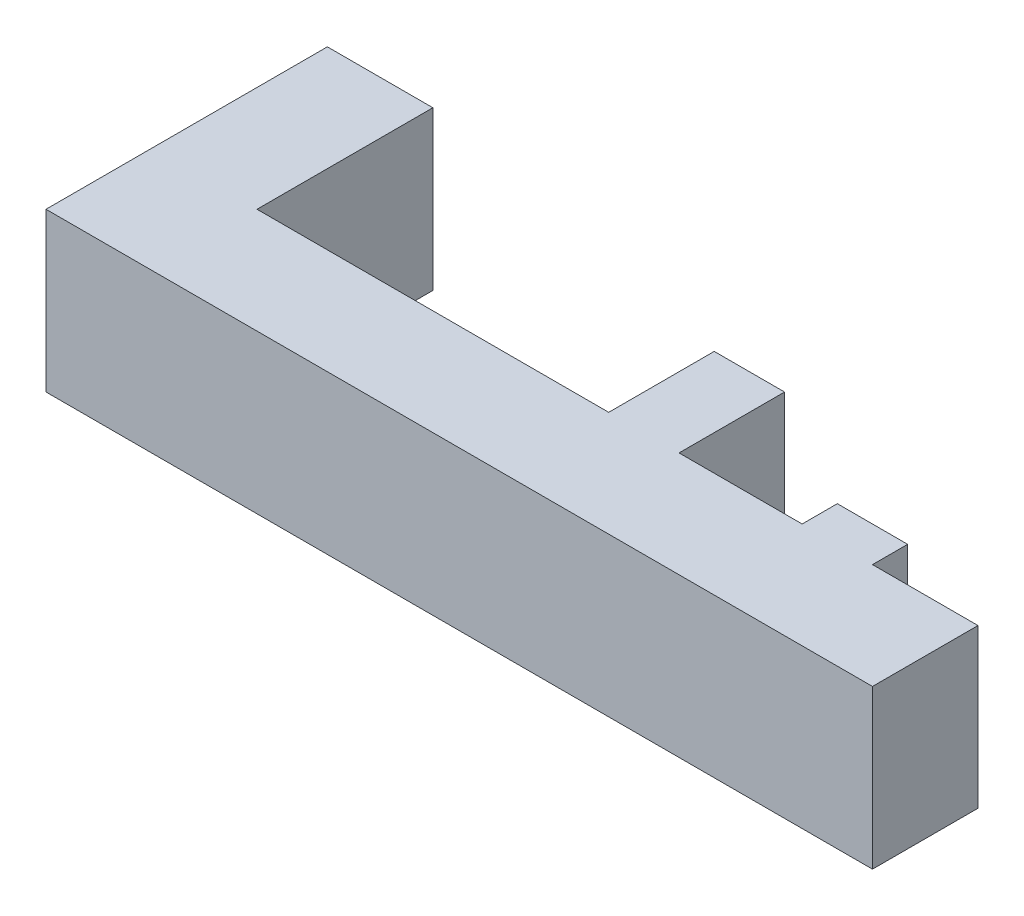
ISO-10303-21;
HEADER;
FILE_DESCRIPTION(('STEP AP214'),'2;1');
FILE_NAME('part.step','',(''),(''),'','','');
FILE_SCHEMA(('AUTOMOTIVE_DESIGN { 1 0 10303 214 1 1 1 1 }'));
ENDSEC;
DATA;
#1=APPLICATION_CONTEXT('core data for automotive mechanical design processes');
#2=APPLICATION_PROTOCOL_DEFINITION('international standard','automotive_design',2000,#1);
#3=PRODUCT_CONTEXT('',#1,'mechanical');
#4=PRODUCT('Part','Part','',(#3));
#5=PRODUCT_RELATED_PRODUCT_CATEGORY('part','',(#4));
#6=PRODUCT_DEFINITION_FORMATION('','',#4);
#7=PRODUCT_DEFINITION_CONTEXT('part definition',#1,'design');
#8=PRODUCT_DEFINITION('design','',#6,#7);
#9=PRODUCT_DEFINITION_SHAPE('','',#8);
#10=(LENGTH_UNIT() NAMED_UNIT(*) SI_UNIT(.MILLI.,.METRE.));
#11=(NAMED_UNIT(*) PLANE_ANGLE_UNIT() SI_UNIT($,.RADIAN.));
#12=(NAMED_UNIT(*) SI_UNIT($,.STERADIAN.) SOLID_ANGLE_UNIT());
#13=UNCERTAINTY_MEASURE_WITH_UNIT(LENGTH_MEASURE(1.E-05),#10,'distance_accuracy_value','');
#14=(GEOMETRIC_REPRESENTATION_CONTEXT(3) GLOBAL_UNCERTAINTY_ASSIGNED_CONTEXT((#13)) GLOBAL_UNIT_ASSIGNED_CONTEXT((#10,
#11,#12)) REPRESENTATION_CONTEXT('',''));
#15=CARTESIAN_POINT('',(0.,0.,0.));
#16=DIRECTION('',(0.,0.,1.));
#17=DIRECTION('',(1.,0.,0.));
#18=AXIS2_PLACEMENT_3D('',#15,#16,#17);
#19=CARTESIAN_POINT('',(13.,4.5,-6.));
#20=DIRECTION('',(0.,0.,1.));
#21=DIRECTION('',(1.,0.,0.));
#22=AXIS2_PLACEMENT_3D('',#19,#20,#21);
#23=PLANE('',#22);
#24=DIRECTION('',(-1.,0.,0.));
#25=VECTOR('',#24,1.);
#26=CARTESIAN_POINT('',(13.,0.,-6.));
#27=LINE('',#26,#25);
#28=CARTESIAN_POINT('',(15.,0.,-6.));
#29=VERTEX_POINT('',#28);
#30=CARTESIAN_POINT('',(13.,0.,-6.));
#31=VERTEX_POINT('',#30);
#32=EDGE_CURVE('E164',#29,#31,#27,.T.);
#33=ORIENTED_EDGE('',*,*,#32,.T.);
#34=DIRECTION('',(0.,-1.,0.));
#35=VECTOR('',#34,1.);
#36=CARTESIAN_POINT('',(13.,4.5,-6.));
#37=LINE('',#36,#35);
#38=CARTESIAN_POINT('',(13.,4.5,-6.));
#39=VERTEX_POINT('',#38);
#40=EDGE_CURVE('E11',#39,#31,#37,.T.);
#41=ORIENTED_EDGE('',*,*,#40,.F.);
#42=DIRECTION('',(-1.,0.,0.));
#43=VECTOR('',#42,1.);
#44=CARTESIAN_POINT('',(13.,4.5,-6.));
#45=LINE('',#44,#43);
#46=CARTESIAN_POINT('',(15.,4.5,-6.));
#47=VERTEX_POINT('',#46);
#48=EDGE_CURVE('E190',#47,#39,#45,.T.);
#49=ORIENTED_EDGE('',*,*,#48,.F.);
#50=DIRECTION('',(0.,-1.,0.));
#51=VECTOR('',#50,1.);
#52=CARTESIAN_POINT('',(15.,4.5,-6.));
#53=LINE('',#52,#51);
#54=EDGE_CURVE('E160',#47,#29,#53,.T.);
#55=ORIENTED_EDGE('',*,*,#54,.T.);
#56=EDGE_LOOP('',(#33,#41,#49,#55));
#57=FACE_BOUND('',#56,.T.);
#58=ADVANCED_FACE('F32',(#57),#23,.F.);
#59=CARTESIAN_POINT('',(13.,4.5,-6.));
#60=DIRECTION('',(1.,0.,0.));
#61=DIRECTION('',(0.,0.,-1.));
#62=AXIS2_PLACEMENT_3D('',#59,#60,#61);
#63=PLANE('',#62);
#64=DIRECTION('',(0.,0.,1.));
#65=VECTOR('',#64,1.);
#66=CARTESIAN_POINT('',(13.,0.,-6.));
#67=LINE('',#66,#65);
#68=CARTESIAN_POINT('',(13.,0.,-3.));
#69=VERTEX_POINT('',#68);
#70=EDGE_CURVE('E167',#31,#69,#67,.T.);
#71=ORIENTED_EDGE('',*,*,#70,.T.);
#72=DIRECTION('',(0.,-1.,0.));
#73=VECTOR('',#72,1.);
#74=CARTESIAN_POINT('',(13.,4.5,-3.));
#75=LINE('',#74,#73);
#76=CARTESIAN_POINT('',(13.,4.5,-3.));
#77=VERTEX_POINT('',#76);
#78=EDGE_CURVE('E40',#77,#69,#75,.T.);
#79=ORIENTED_EDGE('',*,*,#78,.F.);
#80=DIRECTION('',(0.,0.,1.));
#81=VECTOR('',#80,1.);
#82=CARTESIAN_POINT('',(13.,4.5,-6.));
#83=LINE('',#82,#81);
#84=EDGE_CURVE('E109',#39,#77,#83,.T.);
#85=ORIENTED_EDGE('',*,*,#84,.F.);
#86=ORIENTED_EDGE('',*,*,#40,.T.);
#87=EDGE_LOOP('',(#71,#79,#85,#86));
#88=FACE_BOUND('',#87,.T.);
#89=ADVANCED_FACE('F278',(#88),#63,.F.);
#90=CARTESIAN_POINT('',(13.,4.5,-3.));
#91=DIRECTION('',(0.,0.,1.));
#92=DIRECTION('',(1.,0.,0.));
#93=AXIS2_PLACEMENT_3D('',#90,#91,#92);
#94=PLANE('',#93);
#95=DIRECTION('',(-1.,0.,0.));
#96=VECTOR('',#95,1.);
#97=CARTESIAN_POINT('',(13.,0.,-3.));
#98=LINE('',#97,#96);
#99=CARTESIAN_POINT('',(3.,0.,-3.));
#100=VERTEX_POINT('',#99);
#101=EDGE_CURVE('E169',#69,#100,#98,.T.);
#102=ORIENTED_EDGE('',*,*,#101,.T.);
#103=DIRECTION('',(0.,-1.,0.));
#104=VECTOR('',#103,1.);
#105=CARTESIAN_POINT('',(3.,4.5,-3.));
#106=LINE('',#105,#104);
#107=CARTESIAN_POINT('',(3.,4.5,-3.));
#108=VERTEX_POINT('',#107);
#109=EDGE_CURVE('E215',#108,#100,#106,.T.);
#110=ORIENTED_EDGE('',*,*,#109,.F.);
#111=DIRECTION('',(-1.,0.,0.));
#112=VECTOR('',#111,1.);
#113=CARTESIAN_POINT('',(13.,4.5,-3.));
#114=LINE('',#113,#112);
#115=EDGE_CURVE('E223',#77,#108,#114,.T.);
#116=ORIENTED_EDGE('',*,*,#115,.F.);
#117=ORIENTED_EDGE('',*,*,#78,.T.);
#118=EDGE_LOOP('',(#102,#110,#116,#117));
#119=FACE_BOUND('',#118,.T.);
#120=ADVANCED_FACE('F221',(#119),#94,.F.);
#121=CARTESIAN_POINT('',(3.,4.5,-3.));
#122=DIRECTION('',(-1.,0.,0.));
#123=DIRECTION('',(0.,0.,1.));
#124=AXIS2_PLACEMENT_3D('',#121,#122,#123);
#125=PLANE('',#124);
#126=DIRECTION('',(0.,0.,-1.));
#127=VECTOR('',#126,1.);
#128=CARTESIAN_POINT('',(3.,0.,-3.));
#129=LINE('',#128,#127);
#130=CARTESIAN_POINT('',(3.,0.,-8.));
#131=VERTEX_POINT('',#130);
#132=EDGE_CURVE('E171',#100,#131,#129,.T.);
#133=ORIENTED_EDGE('',*,*,#132,.T.);
#134=DIRECTION('',(0.,-1.,0.));
#135=VECTOR('',#134,1.);
#136=CARTESIAN_POINT('',(3.,4.5,-8.));
#137=LINE('',#136,#135);
#138=CARTESIAN_POINT('',(3.,4.5,-8.));
#139=VERTEX_POINT('',#138);
#140=EDGE_CURVE('E212',#139,#131,#137,.T.);
#141=ORIENTED_EDGE('',*,*,#140,.F.);
#142=DIRECTION('',(0.,0.,-1.));
#143=VECTOR('',#142,1.);
#144=CARTESIAN_POINT('',(3.,4.5,-3.));
#145=LINE('',#144,#143);
#146=EDGE_CURVE('E241',#108,#139,#145,.T.);
#147=ORIENTED_EDGE('',*,*,#146,.F.);
#148=ORIENTED_EDGE('',*,*,#109,.T.);
#149=EDGE_LOOP('',(#133,#141,#147,#148));
#150=FACE_BOUND('',#149,.T.);
#151=ADVANCED_FACE('F232',(#150),#125,.F.);
#152=CARTESIAN_POINT('',(3.,4.5,-8.));
#153=DIRECTION('',(0.,0.,1.));
#154=DIRECTION('',(1.,0.,0.));
#155=AXIS2_PLACEMENT_3D('',#152,#153,#154);
#156=PLANE('',#155);
#157=DIRECTION('',(-1.,0.,0.));
#158=VECTOR('',#157,1.);
#159=CARTESIAN_POINT('',(3.,0.,-8.));
#160=LINE('',#159,#158);
#161=CARTESIAN_POINT('',(0.,0.,-8.));
#162=VERTEX_POINT('',#161);
#163=EDGE_CURVE('E173',#131,#162,#160,.T.);
#164=ORIENTED_EDGE('',*,*,#163,.T.);
#165=DIRECTION('',(0.,-1.,0.));
#166=VECTOR('',#165,1.);
#167=CARTESIAN_POINT('',(0.,4.5,-8.));
#168=LINE('',#167,#166);
#169=CARTESIAN_POINT('',(0.,4.5,-8.));
#170=VERTEX_POINT('',#169);
#171=EDGE_CURVE('E209',#170,#162,#168,.T.);
#172=ORIENTED_EDGE('',*,*,#171,.F.);
#173=DIRECTION('',(-1.,0.,0.));
#174=VECTOR('',#173,1.);
#175=CARTESIAN_POINT('',(3.,4.5,-8.));
#176=LINE('',#175,#174);
#177=EDGE_CURVE('E238',#139,#170,#176,.T.);
#178=ORIENTED_EDGE('',*,*,#177,.F.);
#179=ORIENTED_EDGE('',*,*,#140,.T.);
#180=EDGE_LOOP('',(#164,#172,#178,#179));
#181=FACE_BOUND('',#180,.T.);
#182=ADVANCED_FACE('F236',(#181),#156,.F.);
#183=CARTESIAN_POINT('',(0.,4.5,-8.));
#184=DIRECTION('',(1.,0.,0.));
#185=DIRECTION('',(0.,0.,-1.));
#186=AXIS2_PLACEMENT_3D('',#183,#184,#185);
#187=PLANE('',#186);
#188=DIRECTION('',(0.,0.,1.));
#189=VECTOR('',#188,1.);
#190=CARTESIAN_POINT('',(0.,0.,-8.));
#191=LINE('',#190,#189);
#192=CARTESIAN_POINT('',(0.,0.,0.));
#193=VERTEX_POINT('',#192);
#194=EDGE_CURVE('E175',#162,#193,#191,.T.);
#195=ORIENTED_EDGE('',*,*,#194,.T.);
#196=DIRECTION('',(0.,-1.,0.));
#197=VECTOR('',#196,1.);
#198=CARTESIAN_POINT('',(0.,4.5,0.));
#199=LINE('',#198,#197);
#200=CARTESIAN_POINT('',(0.,4.5,0.));
#201=VERTEX_POINT('',#200);
#202=EDGE_CURVE('E206',#201,#193,#199,.T.);
#203=ORIENTED_EDGE('',*,*,#202,.F.);
#204=DIRECTION('',(0.,0.,1.));
#205=VECTOR('',#204,1.);
#206=CARTESIAN_POINT('',(0.,4.5,-8.));
#207=LINE('',#206,#205);
#208=EDGE_CURVE('E240',#170,#201,#207,.T.);
#209=ORIENTED_EDGE('',*,*,#208,.F.);
#210=ORIENTED_EDGE('',*,*,#171,.T.);
#211=EDGE_LOOP('',(#195,#203,#209,#210));
#212=FACE_BOUND('',#211,.T.);
#213=ADVANCED_FACE('F291',(#212),#187,.F.);
#214=CARTESIAN_POINT('',(0.,4.5,0.));
#215=DIRECTION('',(0.,0.,-1.));
#216=DIRECTION('',(-1.,0.,0.));
#217=AXIS2_PLACEMENT_3D('',#214,#215,#216);
#218=PLANE('',#217);
#219=DIRECTION('',(1.,0.,0.));
#220=VECTOR('',#219,1.);
#221=CARTESIAN_POINT('',(0.,0.,0.));
#222=LINE('',#221,#220);
#223=CARTESIAN_POINT('',(23.5,0.,0.));
#224=VERTEX_POINT('',#223);
#225=EDGE_CURVE('E177',#193,#224,#222,.T.);
#226=ORIENTED_EDGE('',*,*,#225,.T.);
#227=DIRECTION('',(0.,-1.,0.));
#228=VECTOR('',#227,1.);
#229=CARTESIAN_POINT('',(23.5,4.5,0.));
#230=LINE('',#229,#228);
#231=CARTESIAN_POINT('',(23.5,4.5,0.));
#232=VERTEX_POINT('',#231);
#233=EDGE_CURVE('E203',#232,#224,#230,.T.);
#234=ORIENTED_EDGE('',*,*,#233,.F.);
#235=DIRECTION('',(1.,0.,0.));
#236=VECTOR('',#235,1.);
#237=CARTESIAN_POINT('',(0.,4.5,0.));
#238=LINE('',#237,#236);
#239=EDGE_CURVE('E243',#201,#232,#238,.T.);
#240=ORIENTED_EDGE('',*,*,#239,.F.);
#241=ORIENTED_EDGE('',*,*,#202,.T.);
#242=EDGE_LOOP('',(#226,#234,#240,#241));
#243=FACE_BOUND('',#242,.T.);
#244=ADVANCED_FACE('F294',(#243),#218,.F.);
#245=CARTESIAN_POINT('',(23.5,4.5,-3.));
#246=DIRECTION('',(-1.,0.,0.));
#247=DIRECTION('',(0.,0.,1.));
#248=AXIS2_PLACEMENT_3D('',#245,#246,#247);
#249=PLANE('',#248);
#250=DIRECTION('',(0.,0.,-1.));
#251=VECTOR('',#250,1.);
#252=CARTESIAN_POINT('',(23.5,0.,-3.));
#253=LINE('',#252,#251);
#254=CARTESIAN_POINT('',(23.5,0.,-3.));
#255=VERTEX_POINT('',#254);
#256=EDGE_CURVE('E179',#224,#255,#253,.T.);
#257=ORIENTED_EDGE('',*,*,#256,.T.);
#258=DIRECTION('',(0.,-1.,0.));
#259=VECTOR('',#258,1.);
#260=CARTESIAN_POINT('',(23.5,4.5,-3.));
#261=LINE('',#260,#259);
#262=CARTESIAN_POINT('',(23.5,4.5,-3.));
#263=VERTEX_POINT('',#262);
#264=EDGE_CURVE('E200',#263,#255,#261,.T.);
#265=ORIENTED_EDGE('',*,*,#264,.F.);
#266=DIRECTION('',(0.,0.,-1.));
#267=VECTOR('',#266,1.);
#268=CARTESIAN_POINT('',(23.5,4.5,-3.));
#269=LINE('',#268,#267);
#270=EDGE_CURVE('E249',#232,#263,#269,.T.);
#271=ORIENTED_EDGE('',*,*,#270,.F.);
#272=ORIENTED_EDGE('',*,*,#233,.T.);
#273=EDGE_LOOP('',(#257,#265,#271,#272));
#274=FACE_BOUND('',#273,.T.);
#275=ADVANCED_FACE('F298',(#274),#249,.F.);
#276=CARTESIAN_POINT('',(20.5,4.5,-3.));
#277=DIRECTION('',(0.,0.,1.));
#278=DIRECTION('',(1.,0.,0.));
#279=AXIS2_PLACEMENT_3D('',#276,#277,#278);
#280=PLANE('',#279);
#281=DIRECTION('',(-1.,0.,0.));
#282=VECTOR('',#281,1.);
#283=CARTESIAN_POINT('',(20.5,0.,-3.));
#284=LINE('',#283,#282);
#285=CARTESIAN_POINT('',(20.5,0.,-3.));
#286=VERTEX_POINT('',#285);
#287=EDGE_CURVE('E181',#255,#286,#284,.T.);
#288=ORIENTED_EDGE('',*,*,#287,.T.);
#289=DIRECTION('',(0.,-1.,0.));
#290=VECTOR('',#289,1.);
#291=CARTESIAN_POINT('',(20.5,4.5,-3.));
#292=LINE('',#291,#290);
#293=CARTESIAN_POINT('',(20.5,4.5,-3.));
#294=VERTEX_POINT('',#293);
#295=EDGE_CURVE('E197',#294,#286,#292,.T.);
#296=ORIENTED_EDGE('',*,*,#295,.F.);
#297=DIRECTION('',(-1.,0.,0.));
#298=VECTOR('',#297,1.);
#299=CARTESIAN_POINT('',(20.5,4.5,-3.));
#300=LINE('',#299,#298);
#301=EDGE_CURVE('E251',#263,#294,#300,.T.);
#302=ORIENTED_EDGE('',*,*,#301,.F.);
#303=ORIENTED_EDGE('',*,*,#264,.T.);
#304=EDGE_LOOP('',(#288,#296,#302,#303));
#305=FACE_BOUND('',#304,.T.);
#306=ADVANCED_FACE('F302',(#305),#280,.F.);
#307=CARTESIAN_POINT('',(20.5,4.5,-4.));
#308=DIRECTION('',(-1.,0.,0.));
#309=DIRECTION('',(0.,0.,1.));
#310=AXIS2_PLACEMENT_3D('',#307,#308,#309);
#311=PLANE('',#310);
#312=DIRECTION('',(0.,0.,-1.));
#313=VECTOR('',#312,1.);
#314=CARTESIAN_POINT('',(20.5,0.,-4.));
#315=LINE('',#314,#313);
#316=CARTESIAN_POINT('',(20.5,0.,-4.));
#317=VERTEX_POINT('',#316);
#318=EDGE_CURVE('E183',#286,#317,#315,.T.);
#319=ORIENTED_EDGE('',*,*,#318,.T.);
#320=DIRECTION('',(0.,-1.,0.));
#321=VECTOR('',#320,1.);
#322=CARTESIAN_POINT('',(20.5,4.5,-4.));
#323=LINE('',#322,#321);
#324=CARTESIAN_POINT('',(20.5,4.5,-4.));
#325=VERTEX_POINT('',#324);
#326=EDGE_CURVE('E194',#325,#317,#323,.T.);
#327=ORIENTED_EDGE('',*,*,#326,.F.);
#328=DIRECTION('',(0.,0.,-1.));
#329=VECTOR('',#328,1.);
#330=CARTESIAN_POINT('',(20.5,4.5,-4.));
#331=LINE('',#330,#329);
#332=EDGE_CURVE('E253',#294,#325,#331,.T.);
#333=ORIENTED_EDGE('',*,*,#332,.F.);
#334=ORIENTED_EDGE('',*,*,#295,.T.);
#335=EDGE_LOOP('',(#319,#327,#333,#334));
#336=FACE_BOUND('',#335,.T.);
#337=ADVANCED_FACE('F259',(#336),#311,.F.);
#338=CARTESIAN_POINT('',(18.5,4.5,-4.));
#339=DIRECTION('',(0.,0.,1.));
#340=DIRECTION('',(1.,0.,0.));
#341=AXIS2_PLACEMENT_3D('',#338,#339,#340);
#342=PLANE('',#341);
#343=DIRECTION('',(-1.,0.,0.));
#344=VECTOR('',#343,1.);
#345=CARTESIAN_POINT('',(18.5,0.,-4.));
#346=LINE('',#345,#344);
#347=CARTESIAN_POINT('',(18.5,0.,-4.));
#348=VERTEX_POINT('',#347);
#349=EDGE_CURVE('E185',#317,#348,#346,.T.);
#350=ORIENTED_EDGE('',*,*,#349,.T.);
#351=DIRECTION('',(0.,-1.,0.));
#352=VECTOR('',#351,1.);
#353=CARTESIAN_POINT('',(18.5,4.5,-4.));
#354=LINE('',#353,#352);
#355=CARTESIAN_POINT('',(18.5,4.5,-4.));
#356=VERTEX_POINT('',#355);
#357=EDGE_CURVE('E155',#356,#348,#354,.T.);
#358=ORIENTED_EDGE('',*,*,#357,.F.);
#359=DIRECTION('',(-1.,0.,0.));
#360=VECTOR('',#359,1.);
#361=CARTESIAN_POINT('',(18.5,4.5,-4.));
#362=LINE('',#361,#360);
#363=EDGE_CURVE('E146',#325,#356,#362,.T.);
#364=ORIENTED_EDGE('',*,*,#363,.F.);
#365=ORIENTED_EDGE('',*,*,#326,.T.);
#366=EDGE_LOOP('',(#350,#358,#364,#365));
#367=FACE_BOUND('',#366,.T.);
#368=ADVANCED_FACE('F263',(#367),#342,.F.);
#369=CARTESIAN_POINT('',(18.5,4.5,-3.));
#370=DIRECTION('',(1.,0.,0.));
#371=DIRECTION('',(0.,0.,-1.));
#372=AXIS2_PLACEMENT_3D('',#369,#370,#371);
#373=PLANE('',#372);
#374=DIRECTION('',(0.,0.,1.));
#375=VECTOR('',#374,1.);
#376=CARTESIAN_POINT('',(18.5,0.,-3.));
#377=LINE('',#376,#375);
#378=CARTESIAN_POINT('',(18.5,0.,-3.));
#379=VERTEX_POINT('',#378);
#380=EDGE_CURVE('E154',#348,#379,#377,.T.);
#381=ORIENTED_EDGE('',*,*,#380,.T.);
#382=DIRECTION('',(0.,-1.,0.));
#383=VECTOR('',#382,1.);
#384=CARTESIAN_POINT('',(18.5,4.5,-3.));
#385=LINE('',#384,#383);
#386=CARTESIAN_POINT('',(18.5,4.5,-3.));
#387=VERTEX_POINT('',#386);
#388=EDGE_CURVE('E151',#387,#379,#385,.T.);
#389=ORIENTED_EDGE('',*,*,#388,.F.);
#390=DIRECTION('',(0.,0.,1.));
#391=VECTOR('',#390,1.);
#392=CARTESIAN_POINT('',(18.5,4.5,-3.));
#393=LINE('',#392,#391);
#394=EDGE_CURVE('E140',#356,#387,#393,.T.);
#395=ORIENTED_EDGE('',*,*,#394,.F.);
#396=ORIENTED_EDGE('',*,*,#357,.T.);
#397=EDGE_LOOP('',(#381,#389,#395,#396));
#398=FACE_BOUND('',#397,.T.);
#399=ADVANCED_FACE('F152',(#398),#373,.F.);
#400=CARTESIAN_POINT('',(15.,4.5,-3.));
#401=DIRECTION('',(0.,0.,1.));
#402=DIRECTION('',(1.,0.,0.));
#403=AXIS2_PLACEMENT_3D('',#400,#401,#402);
#404=PLANE('',#403);
#405=DIRECTION('',(-1.,0.,0.));
#406=VECTOR('',#405,1.);
#407=CARTESIAN_POINT('',(15.,0.,-3.));
#408=LINE('',#407,#406);
#409=CARTESIAN_POINT('',(15.,0.,-3.));
#410=VERTEX_POINT('',#409);
#411=EDGE_CURVE('E95',#379,#410,#408,.T.);
#412=ORIENTED_EDGE('',*,*,#411,.T.);
#413=DIRECTION('',(0.,-1.,0.));
#414=VECTOR('',#413,1.);
#415=CARTESIAN_POINT('',(15.,4.5,-3.));
#416=LINE('',#415,#414);
#417=CARTESIAN_POINT('',(15.,4.5,-3.));
#418=VERTEX_POINT('',#417);
#419=EDGE_CURVE('E156',#418,#410,#416,.T.);
#420=ORIENTED_EDGE('',*,*,#419,.F.);
#421=DIRECTION('',(-1.,0.,0.));
#422=VECTOR('',#421,1.);
#423=CARTESIAN_POINT('',(15.,4.5,-3.));
#424=LINE('',#423,#422);
#425=EDGE_CURVE('E144',#387,#418,#424,.T.);
#426=ORIENTED_EDGE('',*,*,#425,.F.);
#427=ORIENTED_EDGE('',*,*,#388,.T.);
#428=EDGE_LOOP('',(#412,#420,#426,#427));
#429=FACE_BOUND('',#428,.T.);
#430=ADVANCED_FACE('F158',(#429),#404,.F.);
#431=CARTESIAN_POINT('',(15.,4.5,-6.));
#432=DIRECTION('',(-1.,0.,0.));
#433=DIRECTION('',(0.,0.,1.));
#434=AXIS2_PLACEMENT_3D('',#431,#432,#433);
#435=PLANE('',#434);
#436=DIRECTION('',(0.,0.,-1.));
#437=VECTOR('',#436,1.);
#438=CARTESIAN_POINT('',(15.,0.,-6.));
#439=LINE('',#438,#437);
#440=EDGE_CURVE('E101',#410,#29,#439,.T.);
#441=ORIENTED_EDGE('',*,*,#440,.T.);
#442=ORIENTED_EDGE('',*,*,#54,.F.);
#443=DIRECTION('',(0.,0.,-1.));
#444=VECTOR('',#443,1.);
#445=CARTESIAN_POINT('',(15.,4.5,-6.));
#446=LINE('',#445,#444);
#447=EDGE_CURVE('E48',#418,#47,#446,.T.);
#448=ORIENTED_EDGE('',*,*,#447,.F.);
#449=ORIENTED_EDGE('',*,*,#419,.T.);
#450=EDGE_LOOP('',(#441,#442,#448,#449));
#451=FACE_BOUND('',#450,.T.);
#452=ADVANCED_FACE('F267',(#451),#435,.F.);
#453=CARTESIAN_POINT('',(0.,4.5,0.));
#454=DIRECTION('',(0.,-1.,0.));
#455=DIRECTION('',(0.,0.,-1.));
#456=AXIS2_PLACEMENT_3D('',#453,#454,#455);
#457=PLANE('',#456);
#458=ORIENTED_EDGE('',*,*,#48,.T.);
#459=ORIENTED_EDGE('',*,*,#84,.T.);
#460=ORIENTED_EDGE('',*,*,#115,.T.);
#461=ORIENTED_EDGE('',*,*,#146,.T.);
#462=ORIENTED_EDGE('',*,*,#177,.T.);
#463=ORIENTED_EDGE('',*,*,#208,.T.);
#464=ORIENTED_EDGE('',*,*,#239,.T.);
#465=ORIENTED_EDGE('',*,*,#270,.T.);
#466=ORIENTED_EDGE('',*,*,#301,.T.);
#467=ORIENTED_EDGE('',*,*,#332,.T.);
#468=ORIENTED_EDGE('',*,*,#363,.T.);
#469=ORIENTED_EDGE('',*,*,#394,.T.);
#470=ORIENTED_EDGE('',*,*,#425,.T.);
#471=ORIENTED_EDGE('',*,*,#447,.T.);
#472=EDGE_LOOP('',(#458,#459,#460,#461,#462,#463,#464,#465,#466,#467,#468,#469,#470,#471));
#473=FACE_BOUND('',#472,.T.);
#474=ADVANCED_FACE('F142',(#473),#457,.F.);
#475=CARTESIAN_POINT('',(0.,0.,0.));
#476=DIRECTION('',(0.,-1.,0.));
#477=DIRECTION('',(0.,0.,-1.));
#478=AXIS2_PLACEMENT_3D('',#475,#476,#477);
#479=PLANE('',#478);
#480=ORIENTED_EDGE('',*,*,#32,.F.);
#481=ORIENTED_EDGE('',*,*,#440,.F.);
#482=ORIENTED_EDGE('',*,*,#411,.F.);
#483=ORIENTED_EDGE('',*,*,#380,.F.);
#484=ORIENTED_EDGE('',*,*,#349,.F.);
#485=ORIENTED_EDGE('',*,*,#318,.F.);
#486=ORIENTED_EDGE('',*,*,#287,.F.);
#487=ORIENTED_EDGE('',*,*,#256,.F.);
#488=ORIENTED_EDGE('',*,*,#225,.F.);
#489=ORIENTED_EDGE('',*,*,#194,.F.);
#490=ORIENTED_EDGE('',*,*,#163,.F.);
#491=ORIENTED_EDGE('',*,*,#132,.F.);
#492=ORIENTED_EDGE('',*,*,#101,.F.);
#493=ORIENTED_EDGE('',*,*,#70,.F.);
#494=EDGE_LOOP('',(#480,#481,#482,#483,#484,#485,#486,#487,#488,#489,#490,#491,#492,#493));
#495=FACE_BOUND('',#494,.T.);
#496=ADVANCED_FACE('F227',(#495),#479,.T.);
#497=CLOSED_SHELL('',(#58,#89,#120,#151,#182,#213,#244,#275,#306,#337,#368,#399,#430,#452,#474,#496));
#498=MANIFOLD_SOLID_BREP('B2',#497);
#499=ADVANCED_BREP_SHAPE_REPRESENTATION('',(#18,#498),#14);
#500=SHAPE_DEFINITION_REPRESENTATION(#9,#499);
ENDSEC;
END-ISO-10303-21;
